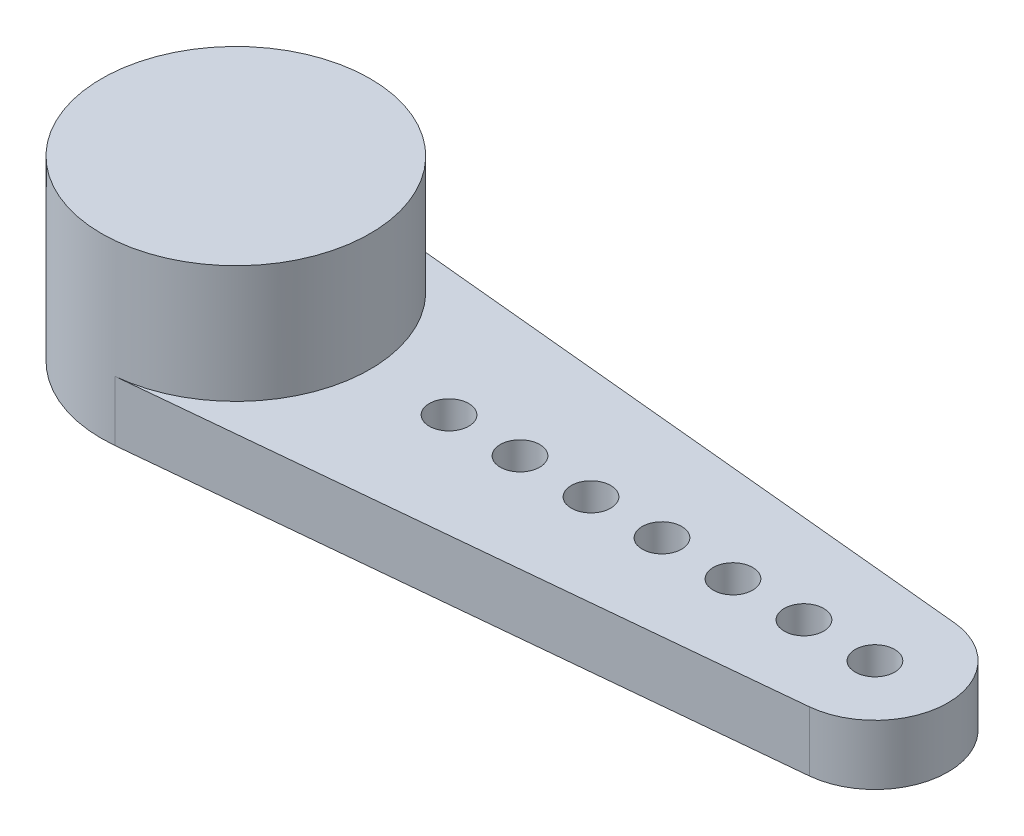
ISO-10303-21;
HEADER;
FILE_DESCRIPTION(('STEP AP214'),'2;1');
FILE_NAME('part.step','',(''),(''),'','','');
FILE_SCHEMA(('AUTOMOTIVE_DESIGN { 1 0 10303 214 1 1 1 1 }'));
ENDSEC;
DATA;
#1=APPLICATION_CONTEXT('core data for automotive mechanical design processes');
#2=APPLICATION_PROTOCOL_DEFINITION('international standard','automotive_design',2000,#1);
#3=PRODUCT_CONTEXT('',#1,'mechanical');
#4=PRODUCT('Part','Part','',(#3));
#5=PRODUCT_RELATED_PRODUCT_CATEGORY('part','',(#4));
#6=PRODUCT_DEFINITION_FORMATION('','',#4);
#7=PRODUCT_DEFINITION_CONTEXT('part definition',#1,'design');
#8=PRODUCT_DEFINITION('design','',#6,#7);
#9=PRODUCT_DEFINITION_SHAPE('','',#8);
#10=(LENGTH_UNIT() NAMED_UNIT(*) SI_UNIT(.MILLI.,.METRE.));
#11=(NAMED_UNIT(*) PLANE_ANGLE_UNIT() SI_UNIT($,.RADIAN.));
#12=(NAMED_UNIT(*) SI_UNIT($,.STERADIAN.) SOLID_ANGLE_UNIT());
#13=UNCERTAINTY_MEASURE_WITH_UNIT(LENGTH_MEASURE(1.E-05),#10,'distance_accuracy_value','');
#14=(GEOMETRIC_REPRESENTATION_CONTEXT(3) GLOBAL_UNCERTAINTY_ASSIGNED_CONTEXT((#13)) GLOBAL_UNIT_ASSIGNED_CONTEXT((#10,
#11,#12)) REPRESENTATION_CONTEXT('',''));
#15=CARTESIAN_POINT('',(0.,0.,0.));
#16=DIRECTION('',(0.,0.,1.));
#17=DIRECTION('',(1.,0.,0.));
#18=AXIS2_PLACEMENT_3D('',#15,#16,#17);
#19=CARTESIAN_POINT('',(0.,4.5,0.));
#20=DIRECTION('',(0.,-1.,0.));
#21=DIRECTION('',(0.,0.,-1.));
#22=AXIS2_PLACEMENT_3D('',#19,#20,#21);
#23=CYLINDRICAL_SURFACE('',#22,3.405);
#24=CARTESIAN_POINT('',(0.,4.5,0.));
#25=DIRECTION('',(0.,1.,0.));
#26=DIRECTION('',(0.,0.,1.));
#27=AXIS2_PLACEMENT_3D('',#24,#25,#26);
#28=CIRCLE('',#27,3.405);
#29=CARTESIAN_POINT('',(0.,4.5,3.405));
#30=VERTEX_POINT('',#29);
#31=EDGE_CURVE('E41',#30,#30,#28,.T.);
#32=ORIENTED_EDGE('',*,*,#31,.F.);
#33=EDGE_LOOP('',(#32));
#34=FACE_BOUND('',#33,.T.);
#35=CARTESIAN_POINT('',(0.,1.52,0.));
#36=DIRECTION('',(0.,-1.,0.));
#37=DIRECTION('',(0.,0.,-1.));
#38=AXIS2_PLACEMENT_3D('',#35,#36,#37);
#39=CIRCLE('',#38,3.405);
#40=CARTESIAN_POINT('',(0.326737118173403,1.52,-3.38928721940288));
#41=VERTEX_POINT('',#40);
#42=CARTESIAN_POINT('',(0.326737118173403,1.52,3.38928721940288));
#43=VERTEX_POINT('',#42);
#44=EDGE_CURVE('E11',#41,#43,#39,.T.);
#45=ORIENTED_EDGE('',*,*,#44,.F.);
#46=DIRECTION('',(0.,-1.,0.));
#47=VECTOR('',#46,1.);
#48=CARTESIAN_POINT('',(0.326737118173404,1.52,-3.38928721940289));
#49=LINE('',#48,#47);
#50=CARTESIAN_POINT('',(0.326737118173404,0.,-3.38928721940289));
#51=VERTEX_POINT('',#50);
#52=EDGE_CURVE('E83',#41,#51,#49,.T.);
#53=ORIENTED_EDGE('',*,*,#52,.T.);
#54=CARTESIAN_POINT('',(0.,0.,0.));
#55=DIRECTION('',(0.,1.,0.));
#56=DIRECTION('',(0.,0.,1.));
#57=AXIS2_PLACEMENT_3D('',#54,#55,#56);
#58=CIRCLE('',#57,3.405);
#59=CARTESIAN_POINT('',(0.326737118173404,0.,3.38928721940289));
#60=VERTEX_POINT('',#59);
#61=EDGE_CURVE('E107',#51,#60,#58,.T.);
#62=ORIENTED_EDGE('',*,*,#61,.T.);
#63=DIRECTION('',(0.,-1.,0.));
#64=VECTOR('',#63,1.);
#65=CARTESIAN_POINT('',(0.326737118173404,1.52,3.38928721940289));
#66=LINE('',#65,#64);
#67=EDGE_CURVE('E51',#43,#60,#66,.T.);
#68=ORIENTED_EDGE('',*,*,#67,.F.);
#69=EDGE_LOOP('',(#45,#53,#62,#68));
#70=FACE_BOUND('',#69,.T.);
#71=ADVANCED_FACE('F34',(#34,#70),#23,.T.);
#72=CARTESIAN_POINT('',(0.,4.5,0.));
#73=DIRECTION('',(0.,1.,0.));
#74=DIRECTION('',(0.,0.,1.));
#75=AXIS2_PLACEMENT_3D('',#72,#73,#74);
#76=PLANE('',#75);
#77=ORIENTED_EDGE('',*,*,#31,.T.);
#78=EDGE_LOOP('',(#77));
#79=FACE_BOUND('',#78,.T.);
#80=ADVANCED_FACE('F117',(#79),#76,.T.);
#81=CARTESIAN_POINT('',(0.,0.,0.));
#82=DIRECTION('',(0.,1.,0.));
#83=DIRECTION('',(0.,0.,1.));
#84=AXIS2_PLACEMENT_3D('',#81,#82,#83);
#85=PLANE('',#84);
#86=CARTESIAN_POINT('',(5.405,0.,0.));
#87=DIRECTION('',(0.,-1.,0.));
#88=DIRECTION('',(0.,0.,-1.));
#89=AXIS2_PLACEMENT_3D('',#86,#87,#88);
#90=CIRCLE('',#89,0.500000000000001);
#91=CARTESIAN_POINT('',(5.405,0.,-0.500000000000041));
#92=VERTEX_POINT('',#91);
#93=EDGE_CURVE('E256',#92,#92,#90,.T.);
#94=ORIENTED_EDGE('',*,*,#93,.F.);
#95=EDGE_LOOP('',(#94));
#96=FACE_BOUND('',#95,.T.);
#97=CARTESIAN_POINT('',(7.205,0.,0.));
#98=DIRECTION('',(0.,-1.,0.));
#99=DIRECTION('',(0.,0.,-1.));
#100=AXIS2_PLACEMENT_3D('',#97,#98,#99);
#101=CIRCLE('',#100,0.500000000000001);
#102=CARTESIAN_POINT('',(7.205,0.,-0.500000000000034));
#103=VERTEX_POINT('',#102);
#104=EDGE_CURVE('E258',#103,#103,#101,.T.);
#105=ORIENTED_EDGE('',*,*,#104,.F.);
#106=EDGE_LOOP('',(#105));
#107=FACE_BOUND('',#106,.T.);
#108=CARTESIAN_POINT('',(9.005,0.,0.));
#109=DIRECTION('',(0.,-1.,0.));
#110=DIRECTION('',(0.,0.,-1.));
#111=AXIS2_PLACEMENT_3D('',#108,#109,#110);
#112=CIRCLE('',#111,0.500000000000001);
#113=CARTESIAN_POINT('',(9.005,0.,-0.500000000000028));
#114=VERTEX_POINT('',#113);
#115=EDGE_CURVE('E264',#114,#114,#112,.T.);
#116=ORIENTED_EDGE('',*,*,#115,.F.);
#117=EDGE_LOOP('',(#116));
#118=FACE_BOUND('',#117,.T.);
#119=CARTESIAN_POINT('',(10.805,0.,0.));
#120=DIRECTION('',(0.,-1.,0.));
#121=DIRECTION('',(0.,0.,-1.));
#122=AXIS2_PLACEMENT_3D('',#119,#120,#121);
#123=CIRCLE('',#122,0.500000000000001);
#124=CARTESIAN_POINT('',(10.805,0.,-0.500000000000021));
#125=VERTEX_POINT('',#124);
#126=EDGE_CURVE('E270',#125,#125,#123,.T.);
#127=ORIENTED_EDGE('',*,*,#126,.F.);
#128=EDGE_LOOP('',(#127));
#129=FACE_BOUND('',#128,.T.);
#130=CARTESIAN_POINT('',(12.605,0.,0.));
#131=DIRECTION('',(0.,-1.,0.));
#132=DIRECTION('',(0.,0.,-1.));
#133=AXIS2_PLACEMENT_3D('',#130,#131,#132);
#134=CIRCLE('',#133,0.499999999999999);
#135=CARTESIAN_POINT('',(12.605,0.,-0.500000000000012));
#136=VERTEX_POINT('',#135);
#137=EDGE_CURVE('E276',#136,#136,#134,.T.);
#138=ORIENTED_EDGE('',*,*,#137,.F.);
#139=EDGE_LOOP('',(#138));
#140=FACE_BOUND('',#139,.T.);
#141=CARTESIAN_POINT('',(14.405,0.,0.));
#142=DIRECTION('',(0.,-1.,0.));
#143=DIRECTION('',(0.,0.,-1.));
#144=AXIS2_PLACEMENT_3D('',#141,#142,#143);
#145=CIRCLE('',#144,0.500000000000001);
#146=CARTESIAN_POINT('',(14.405,0.,-0.500000000000007));
#147=VERTEX_POINT('',#146);
#148=EDGE_CURVE('E282',#147,#147,#145,.T.);
#149=ORIENTED_EDGE('',*,*,#148,.F.);
#150=EDGE_LOOP('',(#149));
#151=FACE_BOUND('',#150,.T.);
#152=CARTESIAN_POINT('',(16.205,0.,0.));
#153=DIRECTION('',(0.,-1.,0.));
#154=DIRECTION('',(0.,0.,-1.));
#155=AXIS2_PLACEMENT_3D('',#152,#153,#154);
#156=CIRCLE('',#155,0.499999999999999);
#157=CARTESIAN_POINT('',(16.205,0.,-0.499999999999999));
#158=VERTEX_POINT('',#157);
#159=EDGE_CURVE('E98',#158,#158,#156,.T.);
#160=ORIENTED_EDGE('',*,*,#159,.F.);
#161=EDGE_LOOP('',(#160));
#162=FACE_BOUND('',#161,.T.);
#163=ORIENTED_EDGE('',*,*,#61,.F.);
#164=DIRECTION('',(0.99538538014769,0.,0.095958037642703));
#165=VECTOR('',#164,1.);
#166=CARTESIAN_POINT('',(0.326737118173404,0.,-3.38928721940289));
#167=LINE('',#166,#165);
#168=CARTESIAN_POINT('',(16.382522369639,0.,-1.84146295327323));
#169=VERTEX_POINT('',#168);
#170=EDGE_CURVE('E102',#51,#169,#167,.T.);
#171=ORIENTED_EDGE('',*,*,#170,.T.);
#172=CARTESIAN_POINT('',(16.205,0.,0.));
#173=DIRECTION('',(0.,-1.,0.));
#174=DIRECTION('',(0.,0.,-1.));
#175=AXIS2_PLACEMENT_3D('',#172,#173,#174);
#176=CIRCLE('',#175,1.85);
#177=CARTESIAN_POINT('',(16.382522369639,0.,1.84146295327323));
#178=VERTEX_POINT('',#177);
#179=EDGE_CURVE('E77',#169,#178,#176,.T.);
#180=ORIENTED_EDGE('',*,*,#179,.T.);
#181=DIRECTION('',(-0.99538538014769,0.,0.095958037642703));
#182=VECTOR('',#181,1.);
#183=CARTESIAN_POINT('',(0.326737118173404,0.,3.38928721940289));
#184=LINE('',#183,#182);
#185=EDGE_CURVE('E93',#178,#60,#184,.T.);
#186=ORIENTED_EDGE('',*,*,#185,.T.);
#187=EDGE_LOOP('',(#163,#171,#180,#186));
#188=FACE_BOUND('',#187,.T.);
#189=ADVANCED_FACE('F115',(#96,#107,#118,#129,#140,#151,#162,#188),#85,.F.);
#190=CARTESIAN_POINT('',(0.,1.52,0.));
#191=DIRECTION('',(0.,-1.,0.));
#192=DIRECTION('',(0.,0.,-1.));
#193=AXIS2_PLACEMENT_3D('',#190,#191,#192);
#194=PLANE('',#193);
#195=CARTESIAN_POINT('',(5.405,1.52,0.));
#196=DIRECTION('',(0.,-1.,0.));
#197=DIRECTION('',(0.,0.,-1.));
#198=AXIS2_PLACEMENT_3D('',#195,#196,#197);
#199=CIRCLE('',#198,0.500000000000001);
#200=CARTESIAN_POINT('',(5.405,1.52,-0.500000000000041));
#201=VERTEX_POINT('',#200);
#202=EDGE_CURVE('E254',#201,#201,#199,.T.);
#203=ORIENTED_EDGE('',*,*,#202,.T.);
#204=EDGE_LOOP('',(#203));
#205=FACE_BOUND('',#204,.T.);
#206=CARTESIAN_POINT('',(7.205,1.52,0.));
#207=DIRECTION('',(0.,-1.,0.));
#208=DIRECTION('',(0.,0.,-1.));
#209=AXIS2_PLACEMENT_3D('',#206,#207,#208);
#210=CIRCLE('',#209,0.500000000000001);
#211=CARTESIAN_POINT('',(7.205,1.52,-0.500000000000034));
#212=VERTEX_POINT('',#211);
#213=EDGE_CURVE('E261',#212,#212,#210,.T.);
#214=ORIENTED_EDGE('',*,*,#213,.T.);
#215=EDGE_LOOP('',(#214));
#216=FACE_BOUND('',#215,.T.);
#217=CARTESIAN_POINT('',(9.005,1.52,0.));
#218=DIRECTION('',(0.,-1.,0.));
#219=DIRECTION('',(0.,0.,-1.));
#220=AXIS2_PLACEMENT_3D('',#217,#218,#219);
#221=CIRCLE('',#220,0.500000000000001);
#222=CARTESIAN_POINT('',(9.005,1.52,-0.500000000000028));
#223=VERTEX_POINT('',#222);
#224=EDGE_CURVE('E267',#223,#223,#221,.T.);
#225=ORIENTED_EDGE('',*,*,#224,.T.);
#226=EDGE_LOOP('',(#225));
#227=FACE_BOUND('',#226,.T.);
#228=CARTESIAN_POINT('',(10.805,1.52,0.));
#229=DIRECTION('',(0.,-1.,0.));
#230=DIRECTION('',(0.,0.,-1.));
#231=AXIS2_PLACEMENT_3D('',#228,#229,#230);
#232=CIRCLE('',#231,0.500000000000001);
#233=CARTESIAN_POINT('',(10.805,1.52,-0.500000000000021));
#234=VERTEX_POINT('',#233);
#235=EDGE_CURVE('E273',#234,#234,#232,.T.);
#236=ORIENTED_EDGE('',*,*,#235,.T.);
#237=EDGE_LOOP('',(#236));
#238=FACE_BOUND('',#237,.T.);
#239=CARTESIAN_POINT('',(12.605,1.52,0.));
#240=DIRECTION('',(0.,-1.,0.));
#241=DIRECTION('',(0.,0.,-1.));
#242=AXIS2_PLACEMENT_3D('',#239,#240,#241);
#243=CIRCLE('',#242,0.499999999999999);
#244=CARTESIAN_POINT('',(12.605,1.52,-0.500000000000012));
#245=VERTEX_POINT('',#244);
#246=EDGE_CURVE('E279',#245,#245,#243,.T.);
#247=ORIENTED_EDGE('',*,*,#246,.T.);
#248=EDGE_LOOP('',(#247));
#249=FACE_BOUND('',#248,.T.);
#250=CARTESIAN_POINT('',(14.405,1.52,0.));
#251=DIRECTION('',(0.,-1.,0.));
#252=DIRECTION('',(0.,0.,-1.));
#253=AXIS2_PLACEMENT_3D('',#250,#251,#252);
#254=CIRCLE('',#253,0.500000000000001);
#255=CARTESIAN_POINT('',(14.405,1.52,-0.500000000000007));
#256=VERTEX_POINT('',#255);
#257=EDGE_CURVE('E285',#256,#256,#254,.T.);
#258=ORIENTED_EDGE('',*,*,#257,.T.);
#259=EDGE_LOOP('',(#258));
#260=FACE_BOUND('',#259,.T.);
#261=CARTESIAN_POINT('',(16.205,1.52,0.));
#262=DIRECTION('',(0.,-1.,0.));
#263=DIRECTION('',(0.,0.,-1.));
#264=AXIS2_PLACEMENT_3D('',#261,#262,#263);
#265=CIRCLE('',#264,0.499999999999999);
#266=CARTESIAN_POINT('',(16.205,1.52,-0.499999999999999));
#267=VERTEX_POINT('',#266);
#268=EDGE_CURVE('E104',#267,#267,#265,.T.);
#269=ORIENTED_EDGE('',*,*,#268,.T.);
#270=EDGE_LOOP('',(#269));
#271=FACE_BOUND('',#270,.T.);
#272=DIRECTION('',(0.99538538014769,0.,0.095958037642703));
#273=VECTOR('',#272,1.);
#274=CARTESIAN_POINT('',(0.326737118173404,1.52,-3.38928721940289));
#275=LINE('',#274,#273);
#276=CARTESIAN_POINT('',(16.382522369639,1.52,-1.84146295327323));
#277=VERTEX_POINT('',#276);
#278=EDGE_CURVE('E88',#41,#277,#275,.T.);
#279=ORIENTED_EDGE('',*,*,#278,.F.);
#280=ORIENTED_EDGE('',*,*,#44,.T.);
#281=DIRECTION('',(-0.99538538014769,0.,0.095958037642703));
#282=VECTOR('',#281,1.);
#283=CARTESIAN_POINT('',(0.326737118173404,1.52,3.38928721940289));
#284=LINE('',#283,#282);
#285=CARTESIAN_POINT('',(16.382522369639,1.52,1.84146295327323));
#286=VERTEX_POINT('',#285);
#287=EDGE_CURVE('E90',#286,#43,#284,.T.);
#288=ORIENTED_EDGE('',*,*,#287,.F.);
#289=CARTESIAN_POINT('',(16.205,1.52,0.));
#290=DIRECTION('',(0.,-1.,0.));
#291=DIRECTION('',(0.,0.,-1.));
#292=AXIS2_PLACEMENT_3D('',#289,#290,#291);
#293=CIRCLE('',#292,1.85);
#294=EDGE_CURVE('E74',#277,#286,#293,.T.);
#295=ORIENTED_EDGE('',*,*,#294,.F.);
#296=EDGE_LOOP('',(#279,#280,#288,#295));
#297=FACE_BOUND('',#296,.T.);
#298=ADVANCED_FACE('F87',(#205,#216,#227,#238,#249,#260,#271,#297),#194,.F.);
#299=CARTESIAN_POINT('',(0.326737118173404,1.52,3.38928721940289));
#300=DIRECTION('',(0.095958037642703,0.,0.99538538014769));
#301=DIRECTION('',(0.99538538014769,0.,-0.095958037642703));
#302=AXIS2_PLACEMENT_3D('',#299,#300,#301);
#303=PLANE('',#302);
#304=ORIENTED_EDGE('',*,*,#185,.F.);
#305=DIRECTION('',(0.,-1.,0.));
#306=VECTOR('',#305,1.);
#307=CARTESIAN_POINT('',(16.382522369639,1.52,1.84146295327323));
#308=LINE('',#307,#306);
#309=EDGE_CURVE('E82',#286,#178,#308,.T.);
#310=ORIENTED_EDGE('',*,*,#309,.F.);
#311=ORIENTED_EDGE('',*,*,#287,.T.);
#312=ORIENTED_EDGE('',*,*,#67,.T.);
#313=EDGE_LOOP('',(#304,#310,#311,#312));
#314=FACE_BOUND('',#313,.T.);
#315=ADVANCED_FACE('F114',(#314),#303,.T.);
#316=CARTESIAN_POINT('',(16.205,1.52,0.));
#317=DIRECTION('',(0.,-1.,0.));
#318=DIRECTION('',(0.,0.,-1.));
#319=AXIS2_PLACEMENT_3D('',#316,#317,#318);
#320=CYLINDRICAL_SURFACE('',#319,1.85);
#321=ORIENTED_EDGE('',*,*,#179,.F.);
#322=DIRECTION('',(0.,-1.,0.));
#323=VECTOR('',#322,1.);
#324=CARTESIAN_POINT('',(16.382522369639,1.52,-1.84146295327323));
#325=LINE('',#324,#323);
#326=EDGE_CURVE('E71',#277,#169,#325,.T.);
#327=ORIENTED_EDGE('',*,*,#326,.F.);
#328=ORIENTED_EDGE('',*,*,#294,.T.);
#329=ORIENTED_EDGE('',*,*,#309,.T.);
#330=EDGE_LOOP('',(#321,#327,#328,#329));
#331=FACE_BOUND('',#330,.T.);
#332=ADVANCED_FACE('F73',(#331),#320,.T.);
#333=CARTESIAN_POINT('',(0.326737118173404,1.52,-3.38928721940289));
#334=DIRECTION('',(0.095958037642703,0.,-0.99538538014769));
#335=DIRECTION('',(-0.99538538014769,0.,-0.095958037642703));
#336=AXIS2_PLACEMENT_3D('',#333,#334,#335);
#337=PLANE('',#336);
#338=ORIENTED_EDGE('',*,*,#170,.F.);
#339=ORIENTED_EDGE('',*,*,#52,.F.);
#340=ORIENTED_EDGE('',*,*,#278,.T.);
#341=ORIENTED_EDGE('',*,*,#326,.T.);
#342=EDGE_LOOP('',(#338,#339,#340,#341));
#343=FACE_BOUND('',#342,.T.);
#344=ADVANCED_FACE('F92',(#343),#337,.T.);
#345=CARTESIAN_POINT('',(16.205,1.52,0.));
#346=DIRECTION('',(0.,-1.,0.));
#347=DIRECTION('',(0.,0.,-1.));
#348=AXIS2_PLACEMENT_3D('',#345,#346,#347);
#349=CYLINDRICAL_SURFACE('',#348,0.499999999999999);
#350=ORIENTED_EDGE('',*,*,#268,.F.);
#351=EDGE_LOOP('',(#350));
#352=FACE_BOUND('',#351,.T.);
#353=ORIENTED_EDGE('',*,*,#159,.T.);
#354=EDGE_LOOP('',(#353));
#355=FACE_BOUND('',#354,.T.);
#356=ADVANCED_FACE('F177',(#352,#355),#349,.F.);
#357=CARTESIAN_POINT('',(14.405,1.52,0.));
#358=DIRECTION('',(0.,-1.,0.));
#359=DIRECTION('',(0.,0.,-1.));
#360=AXIS2_PLACEMENT_3D('',#357,#358,#359);
#361=CYLINDRICAL_SURFACE('',#360,0.500000000000001);
#362=ORIENTED_EDGE('',*,*,#257,.F.);
#363=EDGE_LOOP('',(#362));
#364=FACE_BOUND('',#363,.T.);
#365=ORIENTED_EDGE('',*,*,#148,.T.);
#366=EDGE_LOOP('',(#365));
#367=FACE_BOUND('',#366,.T.);
#368=ADVANCED_FACE('F184',(#364,#367),#361,.F.);
#369=CARTESIAN_POINT('',(12.605,1.52,0.));
#370=DIRECTION('',(0.,-1.,0.));
#371=DIRECTION('',(0.,0.,-1.));
#372=AXIS2_PLACEMENT_3D('',#369,#370,#371);
#373=CYLINDRICAL_SURFACE('',#372,0.499999999999999);
#374=ORIENTED_EDGE('',*,*,#246,.F.);
#375=EDGE_LOOP('',(#374));
#376=FACE_BOUND('',#375,.T.);
#377=ORIENTED_EDGE('',*,*,#137,.T.);
#378=EDGE_LOOP('',(#377));
#379=FACE_BOUND('',#378,.T.);
#380=ADVANCED_FACE('F193',(#376,#379),#373,.F.);
#381=CARTESIAN_POINT('',(10.805,1.52,0.));
#382=DIRECTION('',(0.,-1.,0.));
#383=DIRECTION('',(0.,0.,-1.));
#384=AXIS2_PLACEMENT_3D('',#381,#382,#383);
#385=CYLINDRICAL_SURFACE('',#384,0.500000000000001);
#386=ORIENTED_EDGE('',*,*,#235,.F.);
#387=EDGE_LOOP('',(#386));
#388=FACE_BOUND('',#387,.T.);
#389=ORIENTED_EDGE('',*,*,#126,.T.);
#390=EDGE_LOOP('',(#389));
#391=FACE_BOUND('',#390,.T.);
#392=ADVANCED_FACE('F202',(#388,#391),#385,.F.);
#393=CARTESIAN_POINT('',(9.005,1.52,0.));
#394=DIRECTION('',(0.,-1.,0.));
#395=DIRECTION('',(0.,0.,-1.));
#396=AXIS2_PLACEMENT_3D('',#393,#394,#395);
#397=CYLINDRICAL_SURFACE('',#396,0.500000000000001);
#398=ORIENTED_EDGE('',*,*,#224,.F.);
#399=EDGE_LOOP('',(#398));
#400=FACE_BOUND('',#399,.T.);
#401=ORIENTED_EDGE('',*,*,#115,.T.);
#402=EDGE_LOOP('',(#401));
#403=FACE_BOUND('',#402,.T.);
#404=ADVANCED_FACE('F211',(#400,#403),#397,.F.);
#405=CARTESIAN_POINT('',(7.205,1.52,0.));
#406=DIRECTION('',(0.,-1.,0.));
#407=DIRECTION('',(0.,0.,-1.));
#408=AXIS2_PLACEMENT_3D('',#405,#406,#407);
#409=CYLINDRICAL_SURFACE('',#408,0.500000000000001);
#410=ORIENTED_EDGE('',*,*,#213,.F.);
#411=EDGE_LOOP('',(#410));
#412=FACE_BOUND('',#411,.T.);
#413=ORIENTED_EDGE('',*,*,#104,.T.);
#414=EDGE_LOOP('',(#413));
#415=FACE_BOUND('',#414,.T.);
#416=ADVANCED_FACE('F220',(#412,#415),#409,.F.);
#417=CARTESIAN_POINT('',(5.405,1.52,0.));
#418=DIRECTION('',(0.,-1.,0.));
#419=DIRECTION('',(0.,0.,-1.));
#420=AXIS2_PLACEMENT_3D('',#417,#418,#419);
#421=CYLINDRICAL_SURFACE('',#420,0.500000000000001);
#422=ORIENTED_EDGE('',*,*,#202,.F.);
#423=EDGE_LOOP('',(#422));
#424=FACE_BOUND('',#423,.T.);
#425=ORIENTED_EDGE('',*,*,#93,.T.);
#426=EDGE_LOOP('',(#425));
#427=FACE_BOUND('',#426,.T.);
#428=ADVANCED_FACE('F229',(#424,#427),#421,.F.);
#429=CLOSED_SHELL('',(#71,#80,#189,#298,#315,#332,#344,#356,#368,#380,#392,#404,#416,#428));
#430=MANIFOLD_SOLID_BREP('B2',#429);
#431=ADVANCED_BREP_SHAPE_REPRESENTATION('',(#18,#430),#14);
#432=SHAPE_DEFINITION_REPRESENTATION(#9,#431);
ENDSEC;
END-ISO-10303-21;
